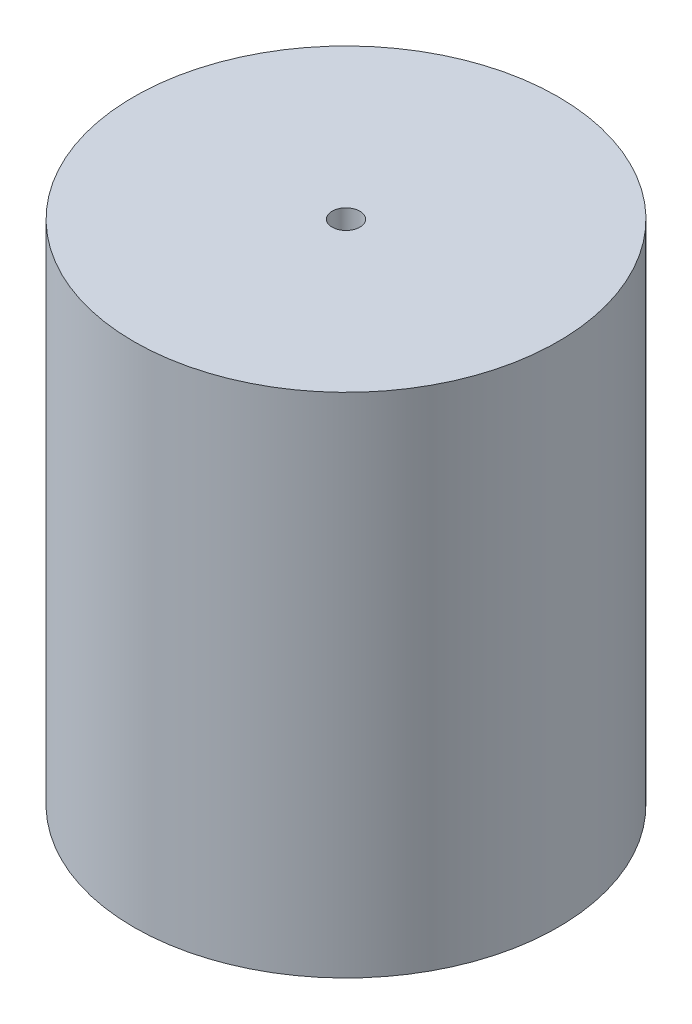
ISO-10303-21;
HEADER;
FILE_DESCRIPTION(('STEP AP214'),'2;1');
FILE_NAME('part.step','',(''),(''),'','','');
FILE_SCHEMA(('AUTOMOTIVE_DESIGN { 1 0 10303 214 1 1 1 1 }'));
ENDSEC;
DATA;
#1=APPLICATION_CONTEXT('core data for automotive mechanical design processes');
#2=APPLICATION_PROTOCOL_DEFINITION('international standard','automotive_design',2000,#1);
#3=PRODUCT_CONTEXT('',#1,'mechanical');
#4=PRODUCT('Part','Part','',(#3));
#5=PRODUCT_RELATED_PRODUCT_CATEGORY('part','',(#4));
#6=PRODUCT_DEFINITION_FORMATION('','',#4);
#7=PRODUCT_DEFINITION_CONTEXT('part definition',#1,'design');
#8=PRODUCT_DEFINITION('design','',#6,#7);
#9=PRODUCT_DEFINITION_SHAPE('','',#8);
#10=(LENGTH_UNIT() NAMED_UNIT(*) SI_UNIT(.MILLI.,.METRE.));
#11=(NAMED_UNIT(*) PLANE_ANGLE_UNIT() SI_UNIT($,.RADIAN.));
#12=(NAMED_UNIT(*) SI_UNIT($,.STERADIAN.) SOLID_ANGLE_UNIT());
#13=UNCERTAINTY_MEASURE_WITH_UNIT(LENGTH_MEASURE(1.E-05),#10,'distance_accuracy_value','');
#14=(GEOMETRIC_REPRESENTATION_CONTEXT(3) GLOBAL_UNCERTAINTY_ASSIGNED_CONTEXT((#13)) GLOBAL_UNIT_ASSIGNED_CONTEXT((#10,
#11,#12)) REPRESENTATION_CONTEXT('',''));
#15=CARTESIAN_POINT('',(0.,0.,0.));
#16=DIRECTION('',(0.,0.,1.));
#17=DIRECTION('',(1.,0.,0.));
#18=AXIS2_PLACEMENT_3D('',#15,#16,#17);
#19=CARTESIAN_POINT('',(0.,27.5,0.));
#20=DIRECTION('',(0.,-1.,0.));
#21=DIRECTION('',(0.,0.,-1.));
#22=AXIS2_PLACEMENT_3D('',#19,#20,#21);
#23=CYLINDRICAL_SURFACE('',#22,11.5);
#24=CARTESIAN_POINT('',(0.,27.5,0.));
#25=DIRECTION('',(0.,1.,0.));
#26=DIRECTION('',(0.,0.,1.));
#27=AXIS2_PLACEMENT_3D('',#24,#25,#26);
#28=CIRCLE('',#27,11.5);
#29=CARTESIAN_POINT('',(0.,27.5,11.5));
#30=VERTEX_POINT('',#29);
#31=EDGE_CURVE('E10',#30,#30,#28,.T.);
#32=ORIENTED_EDGE('',*,*,#31,.F.);
#33=EDGE_LOOP('',(#32));
#34=FACE_BOUND('',#33,.T.);
#35=CARTESIAN_POINT('',(0.,0.,0.));
#36=DIRECTION('',(0.,1.,0.));
#37=DIRECTION('',(0.,0.,1.));
#38=AXIS2_PLACEMENT_3D('',#35,#36,#37);
#39=CIRCLE('',#38,11.5);
#40=CARTESIAN_POINT('',(0.,0.,11.5));
#41=VERTEX_POINT('',#40);
#42=EDGE_CURVE('E37',#41,#41,#39,.T.);
#43=ORIENTED_EDGE('',*,*,#42,.T.);
#44=EDGE_LOOP('',(#43));
#45=FACE_BOUND('',#44,.T.);
#46=ADVANCED_FACE('F34',(#34,#45),#23,.T.);
#47=CARTESIAN_POINT('',(0.,27.5,0.));
#48=DIRECTION('',(0.,1.,0.));
#49=DIRECTION('',(0.,0.,1.));
#50=AXIS2_PLACEMENT_3D('',#47,#48,#49);
#51=PLANE('',#50);
#52=CARTESIAN_POINT('',(0.,27.5,0.));
#53=DIRECTION('',(0.,1.,0.));
#54=DIRECTION('',(0.,0.,1.));
#55=AXIS2_PLACEMENT_3D('',#52,#53,#54);
#56=CIRCLE('',#55,0.7525);
#57=CARTESIAN_POINT('',(0.,27.5,0.7525));
#58=VERTEX_POINT('',#57);
#59=EDGE_CURVE('E46',#58,#58,#56,.T.);
#60=ORIENTED_EDGE('',*,*,#59,.F.);
#61=EDGE_LOOP('',(#60));
#62=FACE_BOUND('',#61,.T.);
#63=ORIENTED_EDGE('',*,*,#31,.T.);
#64=EDGE_LOOP('',(#63));
#65=FACE_BOUND('',#64,.T.);
#66=ADVANCED_FACE('F61',(#62,#65),#51,.T.);
#67=CARTESIAN_POINT('',(0.,0.,0.));
#68=DIRECTION('',(0.,1.,0.));
#69=DIRECTION('',(0.,0.,1.));
#70=AXIS2_PLACEMENT_3D('',#67,#68,#69);
#71=PLANE('',#70);
#72=ORIENTED_EDGE('',*,*,#42,.F.);
#73=EDGE_LOOP('',(#72));
#74=FACE_BOUND('',#73,.T.);
#75=ADVANCED_FACE('F57',(#74),#71,.F.);
#76=CARTESIAN_POINT('',(0.,22.5,0.));
#77=DIRECTION('',(0.,1.,0.));
#78=DIRECTION('',(0.,0.,1.));
#79=AXIS2_PLACEMENT_3D('',#76,#77,#78);
#80=CYLINDRICAL_SURFACE('',#79,0.7525);
#81=CARTESIAN_POINT('',(0.,22.5,0.));
#82=DIRECTION('',(0.,1.,0.));
#83=DIRECTION('',(0.,0.,1.));
#84=AXIS2_PLACEMENT_3D('',#81,#82,#83);
#85=CIRCLE('',#84,0.7525);
#86=CARTESIAN_POINT('',(0.,22.5,0.7525));
#87=VERTEX_POINT('',#86);
#88=EDGE_CURVE('E44',#87,#87,#85,.T.);
#89=ORIENTED_EDGE('',*,*,#88,.F.);
#90=EDGE_LOOP('',(#89));
#91=FACE_BOUND('',#90,.T.);
#92=ORIENTED_EDGE('',*,*,#59,.T.);
#93=EDGE_LOOP('',(#92));
#94=FACE_BOUND('',#93,.T.);
#95=ADVANCED_FACE('F54',(#91,#94),#80,.F.);
#96=CARTESIAN_POINT('',(0.,22.5,0.));
#97=DIRECTION('',(0.,1.,0.));
#98=DIRECTION('',(0.,0.,1.));
#99=AXIS2_PLACEMENT_3D('',#96,#97,#98);
#100=PLANE('',#99);
#101=ORIENTED_EDGE('',*,*,#88,.T.);
#102=EDGE_LOOP('',(#101));
#103=FACE_BOUND('',#102,.T.);
#104=ADVANCED_FACE('F52',(#103),#100,.T.);
#105=CLOSED_SHELL('',(#46,#66,#75,#95,#104));
#106=MANIFOLD_SOLID_BREP('B2',#105);
#107=ADVANCED_BREP_SHAPE_REPRESENTATION('',(#18,#106),#14);
#108=SHAPE_DEFINITION_REPRESENTATION(#9,#107);
ENDSEC;
END-ISO-10303-21;
